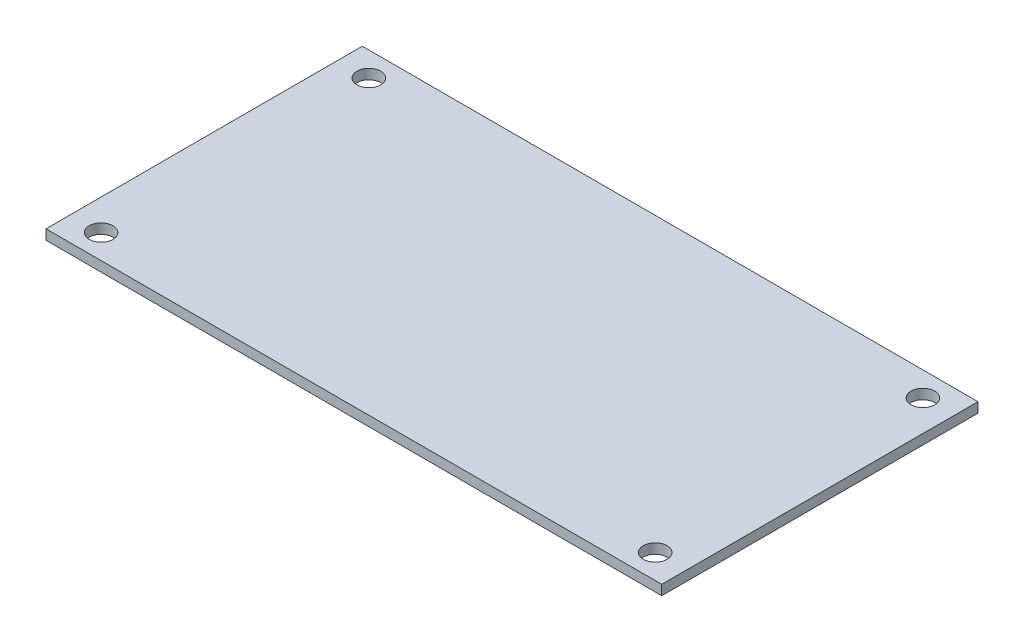
ISO-10303-21;
HEADER;
FILE_DESCRIPTION(('STEP AP214'),'2;1');
FILE_NAME('part.step','',(''),(''),'','','');
FILE_SCHEMA(('AUTOMOTIVE_DESIGN { 1 0 10303 214 1 1 1 1 }'));
ENDSEC;
DATA;
#1=APPLICATION_CONTEXT('core data for automotive mechanical design processes');
#2=APPLICATION_PROTOCOL_DEFINITION('international standard','automotive_design',2000,#1);
#3=PRODUCT_CONTEXT('',#1,'mechanical');
#4=PRODUCT('Part','Part','',(#3));
#5=PRODUCT_RELATED_PRODUCT_CATEGORY('part','',(#4));
#6=PRODUCT_DEFINITION_FORMATION('','',#4);
#7=PRODUCT_DEFINITION_CONTEXT('part definition',#1,'design');
#8=PRODUCT_DEFINITION('design','',#6,#7);
#9=PRODUCT_DEFINITION_SHAPE('','',#8);
#10=(LENGTH_UNIT() NAMED_UNIT(*) SI_UNIT(.MILLI.,.METRE.));
#11=(NAMED_UNIT(*) PLANE_ANGLE_UNIT() SI_UNIT($,.RADIAN.));
#12=(NAMED_UNIT(*) SI_UNIT($,.STERADIAN.) SOLID_ANGLE_UNIT());
#13=UNCERTAINTY_MEASURE_WITH_UNIT(LENGTH_MEASURE(1.E-05),#10,'distance_accuracy_value','');
#14=(GEOMETRIC_REPRESENTATION_CONTEXT(3) GLOBAL_UNCERTAINTY_ASSIGNED_CONTEXT((#13)) GLOBAL_UNIT_ASSIGNED_CONTEXT((#10,
#11,#12)) REPRESENTATION_CONTEXT('',''));
#15=CARTESIAN_POINT('',(0.,0.,0.));
#16=DIRECTION('',(0.,0.,1.));
#17=DIRECTION('',(1.,0.,0.));
#18=AXIS2_PLACEMENT_3D('',#15,#16,#17);
#19=CARTESIAN_POINT('',(0.,1.6,0.));
#20=DIRECTION('',(0.,-1.,0.));
#21=DIRECTION('',(0.,0.,-1.));
#22=AXIS2_PLACEMENT_3D('',#19,#20,#21);
#23=PLANE('',#22);
#24=CARTESIAN_POINT('',(93.95,1.6,-3.90000000000001));
#25=DIRECTION('',(0.,1.,0.));
#26=DIRECTION('',(0.,0.,1.));
#27=AXIS2_PLACEMENT_3D('',#24,#25,#26);
#28=CIRCLE('',#27,1.90500000000001);
#29=CARTESIAN_POINT('',(93.95,1.6,-1.995));
#30=VERTEX_POINT('',#29);
#31=EDGE_CURVE('E137',#30,#30,#28,.T.);
#32=ORIENTED_EDGE('',*,*,#31,.F.);
#33=EDGE_LOOP('',(#32));
#34=FACE_BOUND('',#33,.T.);
#35=CARTESIAN_POINT('',(4.95000000000001,1.6,-46.9));
#36=DIRECTION('',(0.,1.,0.));
#37=DIRECTION('',(0.,0.,1.));
#38=AXIS2_PLACEMENT_3D('',#35,#36,#37);
#39=CIRCLE('',#38,1.905);
#40=CARTESIAN_POINT('',(4.95000000000001,1.6,-44.995));
#41=VERTEX_POINT('',#40);
#42=EDGE_CURVE('E107',#41,#41,#39,.T.);
#43=ORIENTED_EDGE('',*,*,#42,.F.);
#44=EDGE_LOOP('',(#43));
#45=FACE_BOUND('',#44,.T.);
#46=DIRECTION('',(0.,0.,1.));
#47=VECTOR('',#46,1.);
#48=CARTESIAN_POINT('',(0.,1.6,0.));
#49=LINE('',#48,#47);
#50=CARTESIAN_POINT('',(0.,1.6,-50.8));
#51=VERTEX_POINT('',#50);
#52=CARTESIAN_POINT('',(0.,1.6,0.));
#53=VERTEX_POINT('',#52);
#54=EDGE_CURVE('E85',#51,#53,#49,.T.);
#55=ORIENTED_EDGE('',*,*,#54,.T.);
#56=DIRECTION('',(1.,0.,0.));
#57=VECTOR('',#56,1.);
#58=CARTESIAN_POINT('',(0.,1.6,0.));
#59=LINE('',#58,#57);
#60=CARTESIAN_POINT('',(98.9,1.6,0.));
#61=VERTEX_POINT('',#60);
#62=EDGE_CURVE('E80',#53,#61,#59,.T.);
#63=ORIENTED_EDGE('',*,*,#62,.T.);
#64=DIRECTION('',(0.,0.,-1.));
#65=VECTOR('',#64,1.);
#66=CARTESIAN_POINT('',(98.9,1.6,0.));
#67=LINE('',#66,#65);
#68=CARTESIAN_POINT('',(98.9,1.6,-50.8));
#69=VERTEX_POINT('',#68);
#70=EDGE_CURVE('E83',#61,#69,#67,.T.);
#71=ORIENTED_EDGE('',*,*,#70,.T.);
#72=DIRECTION('',(-1.,0.,0.));
#73=VECTOR('',#72,1.);
#74=CARTESIAN_POINT('',(0.,1.6,-50.8));
#75=LINE('',#74,#73);
#76=EDGE_CURVE('E50',#69,#51,#75,.T.);
#77=ORIENTED_EDGE('',*,*,#76,.T.);
#78=EDGE_LOOP('',(#55,#63,#71,#77));
#79=FACE_BOUND('',#78,.T.);
#80=CARTESIAN_POINT('',(93.95,1.6,-46.9));
#81=DIRECTION('',(0.,1.,0.));
#82=DIRECTION('',(0.,0.,1.));
#83=AXIS2_PLACEMENT_3D('',#80,#81,#82);
#84=CIRCLE('',#83,1.90500000000001);
#85=CARTESIAN_POINT('',(93.95,1.6,-44.995));
#86=VERTEX_POINT('',#85);
#87=EDGE_CURVE('E129',#86,#86,#84,.T.);
#88=ORIENTED_EDGE('',*,*,#87,.F.);
#89=EDGE_LOOP('',(#88));
#90=FACE_BOUND('',#89,.T.);
#91=CARTESIAN_POINT('',(4.95000000000001,1.6,-3.90000000000001));
#92=DIRECTION('',(0.,1.,0.));
#93=DIRECTION('',(0.,0.,1.));
#94=AXIS2_PLACEMENT_3D('',#91,#92,#93);
#95=CIRCLE('',#94,1.905);
#96=CARTESIAN_POINT('',(4.95000000000001,1.6,-1.99500000000001));
#97=VERTEX_POINT('',#96);
#98=EDGE_CURVE('E144',#97,#97,#95,.T.);
#99=ORIENTED_EDGE('',*,*,#98,.F.);
#100=EDGE_LOOP('',(#99));
#101=FACE_BOUND('',#100,.T.);
#102=ADVANCED_FACE('F32',(#34,#45,#79,#90,#101),#23,.F.);
#103=CARTESIAN_POINT('',(0.,0.,0.));
#104=DIRECTION('',(0.,-1.,0.));
#105=DIRECTION('',(0.,0.,-1.));
#106=AXIS2_PLACEMENT_3D('',#103,#104,#105);
#107=PLANE('',#106);
#108=CARTESIAN_POINT('',(93.95,0.,-3.90000000000001));
#109=DIRECTION('',(0.,1.,0.));
#110=DIRECTION('',(0.,0.,1.));
#111=AXIS2_PLACEMENT_3D('',#108,#109,#110);
#112=CIRCLE('',#111,1.90500000000001);
#113=CARTESIAN_POINT('',(93.95,0.,-1.995));
#114=VERTEX_POINT('',#113);
#115=EDGE_CURVE('E141',#114,#114,#112,.T.);
#116=ORIENTED_EDGE('',*,*,#115,.T.);
#117=EDGE_LOOP('',(#116));
#118=FACE_BOUND('',#117,.T.);
#119=CARTESIAN_POINT('',(4.95000000000001,0.,-46.9));
#120=DIRECTION('',(0.,1.,0.));
#121=DIRECTION('',(0.,0.,1.));
#122=AXIS2_PLACEMENT_3D('',#119,#120,#121);
#123=CIRCLE('',#122,1.905);
#124=CARTESIAN_POINT('',(4.95000000000001,0.,-44.995));
#125=VERTEX_POINT('',#124);
#126=EDGE_CURVE('E126',#125,#125,#123,.T.);
#127=ORIENTED_EDGE('',*,*,#126,.T.);
#128=EDGE_LOOP('',(#127));
#129=FACE_BOUND('',#128,.T.);
#130=DIRECTION('',(0.,0.,1.));
#131=VECTOR('',#130,1.);
#132=CARTESIAN_POINT('',(0.,0.,0.));
#133=LINE('',#132,#131);
#134=CARTESIAN_POINT('',(0.,0.,-50.8));
#135=VERTEX_POINT('',#134);
#136=CARTESIAN_POINT('',(0.,0.,0.));
#137=VERTEX_POINT('',#136);
#138=EDGE_CURVE('E103',#135,#137,#133,.T.);
#139=ORIENTED_EDGE('',*,*,#138,.F.);
#140=DIRECTION('',(-1.,0.,0.));
#141=VECTOR('',#140,1.);
#142=CARTESIAN_POINT('',(0.,0.,-50.8));
#143=LINE('',#142,#141);
#144=CARTESIAN_POINT('',(98.9,0.,-50.8));
#145=VERTEX_POINT('',#144);
#146=EDGE_CURVE('E73',#145,#135,#143,.T.);
#147=ORIENTED_EDGE('',*,*,#146,.F.);
#148=DIRECTION('',(0.,0.,-1.));
#149=VECTOR('',#148,1.);
#150=CARTESIAN_POINT('',(98.9,0.,0.));
#151=LINE('',#150,#149);
#152=CARTESIAN_POINT('',(98.9,0.,0.));
#153=VERTEX_POINT('',#152);
#154=EDGE_CURVE('E67',#153,#145,#151,.T.);
#155=ORIENTED_EDGE('',*,*,#154,.F.);
#156=DIRECTION('',(1.,0.,0.));
#157=VECTOR('',#156,1.);
#158=CARTESIAN_POINT('',(0.,0.,0.));
#159=LINE('',#158,#157);
#160=EDGE_CURVE('E90',#137,#153,#159,.T.);
#161=ORIENTED_EDGE('',*,*,#160,.F.);
#162=EDGE_LOOP('',(#139,#147,#155,#161));
#163=FACE_BOUND('',#162,.T.);
#164=CARTESIAN_POINT('',(93.95,0.,-46.9));
#165=DIRECTION('',(0.,1.,0.));
#166=DIRECTION('',(0.,0.,1.));
#167=AXIS2_PLACEMENT_3D('',#164,#165,#166);
#168=CIRCLE('',#167,1.90500000000001);
#169=CARTESIAN_POINT('',(93.95,0.,-44.995));
#170=VERTEX_POINT('',#169);
#171=EDGE_CURVE('E133',#170,#170,#168,.T.);
#172=ORIENTED_EDGE('',*,*,#171,.T.);
#173=EDGE_LOOP('',(#172));
#174=FACE_BOUND('',#173,.T.);
#175=CARTESIAN_POINT('',(4.95000000000001,0.,-3.90000000000001));
#176=DIRECTION('',(0.,1.,0.));
#177=DIRECTION('',(0.,0.,1.));
#178=AXIS2_PLACEMENT_3D('',#175,#176,#177);
#179=CIRCLE('',#178,1.905);
#180=CARTESIAN_POINT('',(4.95000000000001,0.,-1.99500000000001));
#181=VERTEX_POINT('',#180);
#182=EDGE_CURVE('E148',#181,#181,#179,.T.);
#183=ORIENTED_EDGE('',*,*,#182,.T.);
#184=EDGE_LOOP('',(#183));
#185=FACE_BOUND('',#184,.T.);
#186=ADVANCED_FACE('F121',(#118,#129,#163,#174,#185),#107,.T.);
#187=CARTESIAN_POINT('',(0.,1.6,0.));
#188=DIRECTION('',(1.,0.,0.));
#189=DIRECTION('',(0.,0.,-1.));
#190=AXIS2_PLACEMENT_3D('',#187,#188,#189);
#191=PLANE('',#190);
#192=ORIENTED_EDGE('',*,*,#138,.T.);
#193=DIRECTION('',(0.,-1.,0.));
#194=VECTOR('',#193,1.);
#195=CARTESIAN_POINT('',(0.,1.6,0.));
#196=LINE('',#195,#194);
#197=EDGE_CURVE('E11',#53,#137,#196,.T.);
#198=ORIENTED_EDGE('',*,*,#197,.F.);
#199=ORIENTED_EDGE('',*,*,#54,.F.);
#200=DIRECTION('',(0.,-1.,0.));
#201=VECTOR('',#200,1.);
#202=CARTESIAN_POINT('',(0.,1.6,-50.8));
#203=LINE('',#202,#201);
#204=EDGE_CURVE('E99',#51,#135,#203,.T.);
#205=ORIENTED_EDGE('',*,*,#204,.T.);
#206=EDGE_LOOP('',(#192,#198,#199,#205));
#207=FACE_BOUND('',#206,.T.);
#208=ADVANCED_FACE('F34',(#207),#191,.F.);
#209=CARTESIAN_POINT('',(0.,1.6,0.));
#210=DIRECTION('',(0.,0.,-1.));
#211=DIRECTION('',(-1.,0.,0.));
#212=AXIS2_PLACEMENT_3D('',#209,#210,#211);
#213=PLANE('',#212);
#214=ORIENTED_EDGE('',*,*,#160,.T.);
#215=DIRECTION('',(0.,-1.,0.));
#216=VECTOR('',#215,1.);
#217=CARTESIAN_POINT('',(98.9,1.6,0.));
#218=LINE('',#217,#216);
#219=EDGE_CURVE('E42',#61,#153,#218,.T.);
#220=ORIENTED_EDGE('',*,*,#219,.F.);
#221=ORIENTED_EDGE('',*,*,#62,.F.);
#222=ORIENTED_EDGE('',*,*,#197,.T.);
#223=EDGE_LOOP('',(#214,#220,#221,#222));
#224=FACE_BOUND('',#223,.T.);
#225=ADVANCED_FACE('F89',(#224),#213,.F.);
#226=CARTESIAN_POINT('',(98.9,1.6,0.));
#227=DIRECTION('',(-1.,0.,0.));
#228=DIRECTION('',(0.,0.,1.));
#229=AXIS2_PLACEMENT_3D('',#226,#227,#228);
#230=PLANE('',#229);
#231=ORIENTED_EDGE('',*,*,#154,.T.);
#232=DIRECTION('',(0.,-1.,0.));
#233=VECTOR('',#232,1.);
#234=CARTESIAN_POINT('',(98.9,1.6,-50.8));
#235=LINE('',#234,#233);
#236=EDGE_CURVE('E92',#69,#145,#235,.T.);
#237=ORIENTED_EDGE('',*,*,#236,.F.);
#238=ORIENTED_EDGE('',*,*,#70,.F.);
#239=ORIENTED_EDGE('',*,*,#219,.T.);
#240=EDGE_LOOP('',(#231,#237,#238,#239));
#241=FACE_BOUND('',#240,.T.);
#242=ADVANCED_FACE('F93',(#241),#230,.F.);
#243=CARTESIAN_POINT('',(0.,1.6,-50.8));
#244=DIRECTION('',(0.,0.,1.));
#245=DIRECTION('',(1.,0.,0.));
#246=AXIS2_PLACEMENT_3D('',#243,#244,#245);
#247=PLANE('',#246);
#248=ORIENTED_EDGE('',*,*,#146,.T.);
#249=ORIENTED_EDGE('',*,*,#204,.F.);
#250=ORIENTED_EDGE('',*,*,#76,.F.);
#251=ORIENTED_EDGE('',*,*,#236,.T.);
#252=EDGE_LOOP('',(#248,#249,#250,#251));
#253=FACE_BOUND('',#252,.T.);
#254=ADVANCED_FACE('F118',(#253),#247,.F.);
#255=CARTESIAN_POINT('',(4.95000000000001,1.6,-46.9));
#256=DIRECTION('',(0.,-1.,0.));
#257=DIRECTION('',(0.,0.,-1.));
#258=AXIS2_PLACEMENT_3D('',#255,#256,#257);
#259=CYLINDRICAL_SURFACE('',#258,1.905);
#260=ORIENTED_EDGE('',*,*,#42,.T.);
#261=EDGE_LOOP('',(#260));
#262=FACE_BOUND('',#261,.T.);
#263=ORIENTED_EDGE('',*,*,#126,.F.);
#264=EDGE_LOOP('',(#263));
#265=FACE_BOUND('',#264,.T.);
#266=ADVANCED_FACE('F169',(#262,#265),#259,.F.);
#267=CARTESIAN_POINT('',(93.95,1.6,-46.9));
#268=DIRECTION('',(0.,-1.,0.));
#269=DIRECTION('',(0.,0.,-1.));
#270=AXIS2_PLACEMENT_3D('',#267,#268,#269);
#271=CYLINDRICAL_SURFACE('',#270,1.90500000000001);
#272=ORIENTED_EDGE('',*,*,#87,.T.);
#273=EDGE_LOOP('',(#272));
#274=FACE_BOUND('',#273,.T.);
#275=ORIENTED_EDGE('',*,*,#171,.F.);
#276=EDGE_LOOP('',(#275));
#277=FACE_BOUND('',#276,.T.);
#278=ADVANCED_FACE('F215',(#274,#277),#271,.F.);
#279=CARTESIAN_POINT('',(93.95,1.6,-3.90000000000001));
#280=DIRECTION('',(0.,-1.,0.));
#281=DIRECTION('',(0.,0.,-1.));
#282=AXIS2_PLACEMENT_3D('',#279,#280,#281);
#283=CYLINDRICAL_SURFACE('',#282,1.90500000000001);
#284=ORIENTED_EDGE('',*,*,#31,.T.);
#285=EDGE_LOOP('',(#284));
#286=FACE_BOUND('',#285,.T.);
#287=ORIENTED_EDGE('',*,*,#115,.F.);
#288=EDGE_LOOP('',(#287));
#289=FACE_BOUND('',#288,.T.);
#290=ADVANCED_FACE('F223',(#286,#289),#283,.F.);
#291=CARTESIAN_POINT('',(4.95000000000001,1.6,-3.90000000000001));
#292=DIRECTION('',(0.,-1.,0.));
#293=DIRECTION('',(0.,0.,-1.));
#294=AXIS2_PLACEMENT_3D('',#291,#292,#293);
#295=CYLINDRICAL_SURFACE('',#294,1.905);
#296=ORIENTED_EDGE('',*,*,#98,.T.);
#297=EDGE_LOOP('',(#296));
#298=FACE_BOUND('',#297,.T.);
#299=ORIENTED_EDGE('',*,*,#182,.F.);
#300=EDGE_LOOP('',(#299));
#301=FACE_BOUND('',#300,.T.);
#302=ADVANCED_FACE('F155',(#298,#301),#295,.F.);
#303=CLOSED_SHELL('',(#102,#186,#208,#225,#242,#254,#266,#278,#290,#302));
#304=MANIFOLD_SOLID_BREP('B2',#303);
#305=ADVANCED_BREP_SHAPE_REPRESENTATION('',(#18,#304),#14);
#306=SHAPE_DEFINITION_REPRESENTATION(#9,#305);
ENDSEC;
END-ISO-10303-21;
